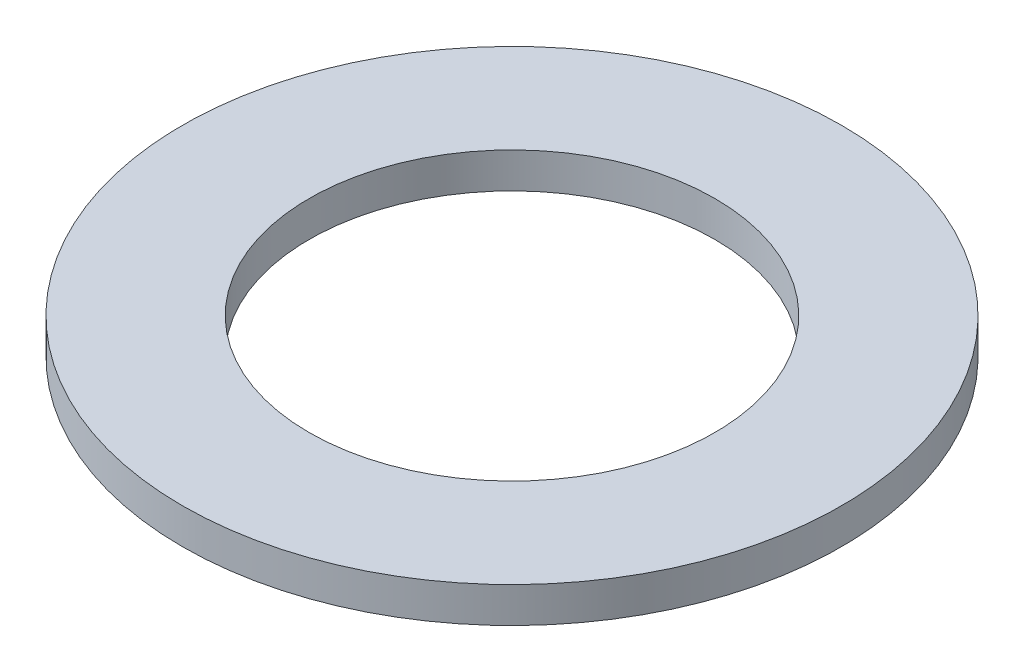
ISO-10303-21;
HEADER;
FILE_DESCRIPTION(('STEP AP214'),'2;1');
FILE_NAME('part.step','',(''),(''),'','','');
FILE_SCHEMA(('AUTOMOTIVE_DESIGN { 1 0 10303 214 1 1 1 1 }'));
ENDSEC;
DATA;
#1=APPLICATION_CONTEXT('core data for automotive mechanical design processes');
#2=APPLICATION_PROTOCOL_DEFINITION('international standard','automotive_design',2000,#1);
#3=PRODUCT_CONTEXT('',#1,'mechanical');
#4=PRODUCT('Part','Part','',(#3));
#5=PRODUCT_RELATED_PRODUCT_CATEGORY('part','',(#4));
#6=PRODUCT_DEFINITION_FORMATION('','',#4);
#7=PRODUCT_DEFINITION_CONTEXT('part definition',#1,'design');
#8=PRODUCT_DEFINITION('design','',#6,#7);
#9=PRODUCT_DEFINITION_SHAPE('','',#8);
#10=(LENGTH_UNIT() NAMED_UNIT(*) SI_UNIT(.MILLI.,.METRE.));
#11=(NAMED_UNIT(*) PLANE_ANGLE_UNIT() SI_UNIT($,.RADIAN.));
#12=(NAMED_UNIT(*) SI_UNIT($,.STERADIAN.) SOLID_ANGLE_UNIT());
#13=UNCERTAINTY_MEASURE_WITH_UNIT(LENGTH_MEASURE(1.E-05),#10,'distance_accuracy_value','');
#14=(GEOMETRIC_REPRESENTATION_CONTEXT(3) GLOBAL_UNCERTAINTY_ASSIGNED_CONTEXT((#13)) GLOBAL_UNIT_ASSIGNED_CONTEXT((#10,
#11,#12)) REPRESENTATION_CONTEXT('',''));
#15=CARTESIAN_POINT('',(0.,0.,0.));
#16=DIRECTION('',(0.,0.,1.));
#17=DIRECTION('',(1.,0.,0.));
#18=AXIS2_PLACEMENT_3D('',#15,#16,#17);
#19=CARTESIAN_POINT('',(0.,7.,0.));
#20=DIRECTION('',(0.,-1.,0.));
#21=DIRECTION('',(0.,0.,-1.));
#22=AXIS2_PLACEMENT_3D('',#19,#20,#21);
#23=CYLINDRICAL_SURFACE('',#22,65.);
#24=CARTESIAN_POINT('',(0.,7.,0.));
#25=DIRECTION('',(0.,1.,0.));
#26=DIRECTION('',(0.,0.,1.));
#27=AXIS2_PLACEMENT_3D('',#24,#25,#26);
#28=CIRCLE('',#27,65.);
#29=CARTESIAN_POINT('',(0.,7.,65.));
#30=VERTEX_POINT('',#29);
#31=EDGE_CURVE('E10',#30,#30,#28,.T.);
#32=ORIENTED_EDGE('',*,*,#31,.F.);
#33=EDGE_LOOP('',(#32));
#34=FACE_BOUND('',#33,.T.);
#35=CARTESIAN_POINT('',(0.,0.,0.));
#36=DIRECTION('',(0.,1.,0.));
#37=DIRECTION('',(0.,0.,1.));
#38=AXIS2_PLACEMENT_3D('',#35,#36,#37);
#39=CIRCLE('',#38,65.);
#40=CARTESIAN_POINT('',(0.,0.,65.));
#41=VERTEX_POINT('',#40);
#42=EDGE_CURVE('E37',#41,#41,#39,.T.);
#43=ORIENTED_EDGE('',*,*,#42,.T.);
#44=EDGE_LOOP('',(#43));
#45=FACE_BOUND('',#44,.T.);
#46=ADVANCED_FACE('F40',(#34,#45),#23,.T.);
#47=CARTESIAN_POINT('',(0.,7.,0.));
#48=DIRECTION('',(0.,1.,0.));
#49=DIRECTION('',(0.,0.,1.));
#50=AXIS2_PLACEMENT_3D('',#47,#48,#49);
#51=PLANE('',#50);
#52=CARTESIAN_POINT('',(0.,7.,0.));
#53=DIRECTION('',(0.,1.,0.));
#54=DIRECTION('',(0.,0.,1.));
#55=AXIS2_PLACEMENT_3D('',#52,#53,#54);
#56=CIRCLE('',#55,40.);
#57=CARTESIAN_POINT('',(0.,7.,40.));
#58=VERTEX_POINT('',#57);
#59=EDGE_CURVE('E50',#58,#58,#56,.T.);
#60=ORIENTED_EDGE('',*,*,#59,.F.);
#61=EDGE_LOOP('',(#60));
#62=FACE_BOUND('',#61,.T.);
#63=ORIENTED_EDGE('',*,*,#31,.T.);
#64=EDGE_LOOP('',(#63));
#65=FACE_BOUND('',#64,.T.);
#66=ADVANCED_FACE('F59',(#62,#65),#51,.T.);
#67=CARTESIAN_POINT('',(0.,0.,0.));
#68=DIRECTION('',(0.,1.,0.));
#69=DIRECTION('',(0.,0.,1.));
#70=AXIS2_PLACEMENT_3D('',#67,#68,#69);
#71=PLANE('',#70);
#72=CARTESIAN_POINT('',(0.,0.,0.));
#73=DIRECTION('',(0.,1.,0.));
#74=DIRECTION('',(0.,0.,1.));
#75=AXIS2_PLACEMENT_3D('',#72,#73,#74);
#76=CIRCLE('',#75,40.);
#77=CARTESIAN_POINT('',(0.,0.,40.));
#78=VERTEX_POINT('',#77);
#79=EDGE_CURVE('E47',#78,#78,#76,.T.);
#80=ORIENTED_EDGE('',*,*,#79,.T.);
#81=EDGE_LOOP('',(#80));
#82=FACE_BOUND('',#81,.T.);
#83=ORIENTED_EDGE('',*,*,#42,.F.);
#84=EDGE_LOOP('',(#83));
#85=FACE_BOUND('',#84,.T.);
#86=ADVANCED_FACE('F58',(#82,#85),#71,.F.);
#87=CARTESIAN_POINT('',(0.,7.,0.));
#88=DIRECTION('',(0.,-1.,0.));
#89=DIRECTION('',(0.,0.,-1.));
#90=AXIS2_PLACEMENT_3D('',#87,#88,#89);
#91=CYLINDRICAL_SURFACE('',#90,40.);
#92=ORIENTED_EDGE('',*,*,#59,.T.);
#93=EDGE_LOOP('',(#92));
#94=FACE_BOUND('',#93,.T.);
#95=ORIENTED_EDGE('',*,*,#79,.F.);
#96=EDGE_LOOP('',(#95));
#97=FACE_BOUND('',#96,.T.);
#98=ADVANCED_FACE('F54',(#94,#97),#91,.F.);
#99=CLOSED_SHELL('',(#46,#66,#86,#98));
#100=MANIFOLD_SOLID_BREP('B2',#99);
#101=ADVANCED_BREP_SHAPE_REPRESENTATION('',(#18,#100),#14);
#102=SHAPE_DEFINITION_REPRESENTATION(#9,#101);
ENDSEC;
END-ISO-10303-21;
